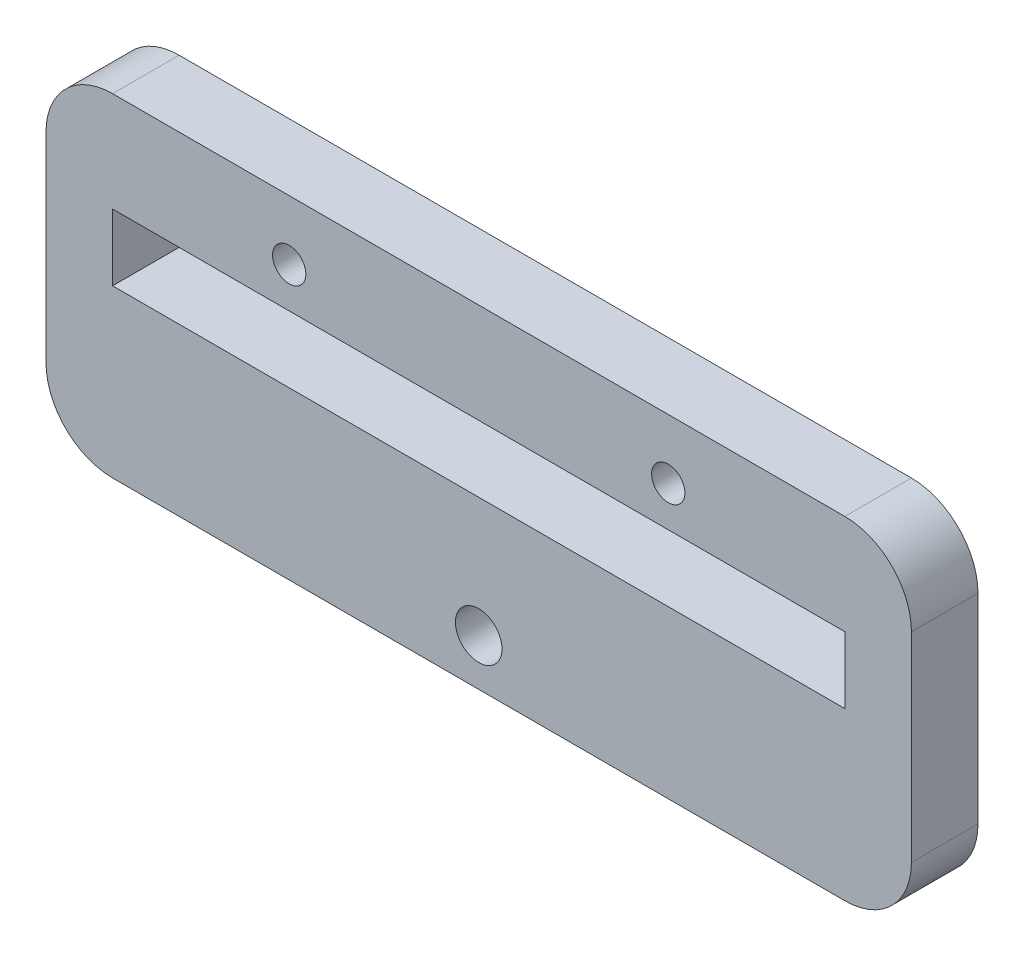
ISO-10303-21;
HEADER;
FILE_DESCRIPTION(('STEP AP214'),'2;1');
FILE_NAME('part.step','',(''),(''),'','','');
FILE_SCHEMA(('AUTOMOTIVE_DESIGN { 1 0 10303 214 1 1 1 1 }'));
ENDSEC;
DATA;
#1=APPLICATION_CONTEXT('core data for automotive mechanical design processes');
#2=APPLICATION_PROTOCOL_DEFINITION('international standard','automotive_design',2000,#1);
#3=PRODUCT_CONTEXT('',#1,'mechanical');
#4=PRODUCT('Part','Part','',(#3));
#5=PRODUCT_RELATED_PRODUCT_CATEGORY('part','',(#4));
#6=PRODUCT_DEFINITION_FORMATION('','',#4);
#7=PRODUCT_DEFINITION_CONTEXT('part definition',#1,'design');
#8=PRODUCT_DEFINITION('design','',#6,#7);
#9=PRODUCT_DEFINITION_SHAPE('','',#8);
#10=(LENGTH_UNIT() NAMED_UNIT(*) SI_UNIT(.MILLI.,.METRE.));
#11=(NAMED_UNIT(*) PLANE_ANGLE_UNIT() SI_UNIT($,.RADIAN.));
#12=(NAMED_UNIT(*) SI_UNIT($,.STERADIAN.) SOLID_ANGLE_UNIT());
#13=UNCERTAINTY_MEASURE_WITH_UNIT(LENGTH_MEASURE(1.E-05),#10,'distance_accuracy_value','');
#14=(GEOMETRIC_REPRESENTATION_CONTEXT(3) GLOBAL_UNCERTAINTY_ASSIGNED_CONTEXT((#13)) GLOBAL_UNIT_ASSIGNED_CONTEXT((#10,
#11,#12)) REPRESENTATION_CONTEXT('',''));
#15=CARTESIAN_POINT('',(0.,0.,0.));
#16=DIRECTION('',(0.,0.,1.));
#17=DIRECTION('',(1.,0.,0.));
#18=AXIS2_PLACEMENT_3D('',#15,#16,#17);
#19=CARTESIAN_POINT('',(0.,0.,10.));
#20=DIRECTION('',(0.,0.,-1.));
#21=DIRECTION('',(-1.,0.,0.));
#22=AXIS2_PLACEMENT_3D('',#19,#20,#21);
#23=PLANE('',#22);
#24=DIRECTION('',(0.,-1.,0.));
#25=VECTOR('',#24,1.);
#26=CARTESIAN_POINT('',(0.,0.,10.));
#27=LINE('',#26,#25);
#28=CARTESIAN_POINT('',(0.,40.,10.));
#29=VERTEX_POINT('',#28);
#30=CARTESIAN_POINT('',(0.,10.,10.));
#31=VERTEX_POINT('',#30);
#32=EDGE_CURVE('E167',#29,#31,#27,.T.);
#33=ORIENTED_EDGE('',*,*,#32,.T.);
#34=CARTESIAN_POINT('',(10.,10.,10.));
#35=DIRECTION('',(0.,0.,-1.));
#36=DIRECTION('',(-1.,0.,0.));
#37=AXIS2_PLACEMENT_3D('',#34,#35,#36);
#38=CIRCLE('',#37,10.);
#39=CARTESIAN_POINT('',(10.,0.,10.));
#40=VERTEX_POINT('',#39);
#41=EDGE_CURVE('E210',#31,#40,#38,.F.);
#42=ORIENTED_EDGE('',*,*,#41,.T.);
#43=DIRECTION('',(1.,0.,0.));
#44=VECTOR('',#43,1.);
#45=CARTESIAN_POINT('',(0.,0.,10.));
#46=LINE('',#45,#44);
#47=CARTESIAN_POINT('',(120.,0.,10.));
#48=VERTEX_POINT('',#47);
#49=EDGE_CURVE('E170',#40,#48,#46,.T.);
#50=ORIENTED_EDGE('',*,*,#49,.T.);
#51=CARTESIAN_POINT('',(120.,10.,10.));
#52=DIRECTION('',(0.,0.,-1.));
#53=DIRECTION('',(-1.,0.,0.));
#54=AXIS2_PLACEMENT_3D('',#51,#52,#53);
#55=CIRCLE('',#54,10.);
#56=CARTESIAN_POINT('',(130.,10.,10.));
#57=VERTEX_POINT('',#56);
#58=EDGE_CURVE('E208',#48,#57,#55,.F.);
#59=ORIENTED_EDGE('',*,*,#58,.T.);
#60=DIRECTION('',(0.,1.,0.));
#61=VECTOR('',#60,1.);
#62=CARTESIAN_POINT('',(130.,0.,10.));
#63=LINE('',#62,#61);
#64=CARTESIAN_POINT('',(130.,40.,10.));
#65=VERTEX_POINT('',#64);
#66=EDGE_CURVE('E174',#57,#65,#63,.T.);
#67=ORIENTED_EDGE('',*,*,#66,.T.);
#68=CARTESIAN_POINT('',(120.,40.,10.));
#69=DIRECTION('',(0.,0.,-1.));
#70=DIRECTION('',(-1.,0.,0.));
#71=AXIS2_PLACEMENT_3D('',#68,#69,#70);
#72=CIRCLE('',#71,10.);
#73=CARTESIAN_POINT('',(120.,50.,10.));
#74=VERTEX_POINT('',#73);
#75=EDGE_CURVE('E53',#65,#74,#72,.F.);
#76=ORIENTED_EDGE('',*,*,#75,.T.);
#77=DIRECTION('',(-1.,0.,0.));
#78=VECTOR('',#77,1.);
#79=CARTESIAN_POINT('',(0.,50.,10.));
#80=LINE('',#79,#78);
#81=CARTESIAN_POINT('',(10.,50.,10.));
#82=VERTEX_POINT('',#81);
#83=EDGE_CURVE('E176',#74,#82,#80,.T.);
#84=ORIENTED_EDGE('',*,*,#83,.T.);
#85=CARTESIAN_POINT('',(10.,40.,10.));
#86=DIRECTION('',(0.,0.,-1.));
#87=DIRECTION('',(-1.,0.,0.));
#88=AXIS2_PLACEMENT_3D('',#85,#86,#87);
#89=CIRCLE('',#88,10.);
#90=EDGE_CURVE('E206',#82,#29,#89,.F.);
#91=ORIENTED_EDGE('',*,*,#90,.T.);
#92=EDGE_LOOP('',(#33,#42,#50,#59,#67,#76,#84,#91));
#93=FACE_BOUND('',#92,.T.);
#94=DIRECTION('',(0.,-1.,0.));
#95=VECTOR('',#94,1.);
#96=CARTESIAN_POINT('',(10.,25.,10.));
#97=LINE('',#96,#95);
#98=CARTESIAN_POINT('',(10.,35.,10.));
#99=VERTEX_POINT('',#98);
#100=CARTESIAN_POINT('',(10.,25.,10.));
#101=VERTEX_POINT('',#100);
#102=EDGE_CURVE('E123',#99,#101,#97,.T.);
#103=ORIENTED_EDGE('',*,*,#102,.F.);
#104=DIRECTION('',(-1.,0.,0.));
#105=VECTOR('',#104,1.);
#106=CARTESIAN_POINT('',(10.,35.,10.));
#107=LINE('',#106,#105);
#108=CARTESIAN_POINT('',(120.,35.,10.));
#109=VERTEX_POINT('',#108);
#110=EDGE_CURVE('E149',#109,#99,#107,.T.);
#111=ORIENTED_EDGE('',*,*,#110,.F.);
#112=DIRECTION('',(0.,1.,0.));
#113=VECTOR('',#112,1.);
#114=CARTESIAN_POINT('',(120.,25.,10.));
#115=LINE('',#114,#113);
#116=CARTESIAN_POINT('',(120.,25.,10.));
#117=VERTEX_POINT('',#116);
#118=EDGE_CURVE('E147',#117,#109,#115,.T.);
#119=ORIENTED_EDGE('',*,*,#118,.F.);
#120=DIRECTION('',(1.,0.,0.));
#121=VECTOR('',#120,1.);
#122=CARTESIAN_POINT('',(10.,25.,10.));
#123=LINE('',#122,#121);
#124=EDGE_CURVE('E133',#101,#117,#123,.T.);
#125=ORIENTED_EDGE('',*,*,#124,.F.);
#126=EDGE_LOOP('',(#103,#111,#119,#125));
#127=FACE_BOUND('',#126,.T.);
#128=CARTESIAN_POINT('',(36.53,41.03,10.));
#129=DIRECTION('',(0.,0.,1.));
#130=DIRECTION('',(1.,0.,0.));
#131=AXIS2_PLACEMENT_3D('',#128,#129,#130);
#132=CIRCLE('',#131,2.5);
#133=CARTESIAN_POINT('',(39.03,41.03,10.));
#134=VERTEX_POINT('',#133);
#135=EDGE_CURVE('E156',#134,#134,#132,.T.);
#136=ORIENTED_EDGE('',*,*,#135,.F.);
#137=EDGE_LOOP('',(#136));
#138=FACE_BOUND('',#137,.T.);
#139=CARTESIAN_POINT('',(93.47,41.03,10.));
#140=DIRECTION('',(0.,0.,1.));
#141=DIRECTION('',(1.,0.,0.));
#142=AXIS2_PLACEMENT_3D('',#139,#140,#141);
#143=CIRCLE('',#142,2.5);
#144=CARTESIAN_POINT('',(95.97,41.03,10.));
#145=VERTEX_POINT('',#144);
#146=EDGE_CURVE('E405',#145,#145,#143,.T.);
#147=ORIENTED_EDGE('',*,*,#146,.F.);
#148=EDGE_LOOP('',(#147));
#149=FACE_BOUND('',#148,.T.);
#150=CARTESIAN_POINT('',(65.,7.,10.));
#151=DIRECTION('',(0.,0.,1.));
#152=DIRECTION('',(1.,0.,0.));
#153=AXIS2_PLACEMENT_3D('',#150,#151,#152);
#154=CIRCLE('',#153,3.50000000000001);
#155=CARTESIAN_POINT('',(68.5,7.,10.));
#156=VERTEX_POINT('',#155);
#157=EDGE_CURVE('E412',#156,#156,#154,.T.);
#158=ORIENTED_EDGE('',*,*,#157,.F.);
#159=EDGE_LOOP('',(#158));
#160=FACE_BOUND('',#159,.T.);
#161=ADVANCED_FACE('F33',(#93,#127,#138,#149,#160),#23,.F.);
#162=CARTESIAN_POINT('',(0.,0.,0.));
#163=DIRECTION('',(0.,0.,-1.));
#164=DIRECTION('',(-1.,0.,0.));
#165=AXIS2_PLACEMENT_3D('',#162,#163,#164);
#166=PLANE('',#165);
#167=CARTESIAN_POINT('',(93.47,41.03,0.));
#168=DIRECTION('',(0.,0.,1.));
#169=DIRECTION('',(1.,0.,0.));
#170=AXIS2_PLACEMENT_3D('',#167,#168,#169);
#171=CIRCLE('',#170,2.5);
#172=CARTESIAN_POINT('',(95.97,41.03,0.));
#173=VERTEX_POINT('',#172);
#174=EDGE_CURVE('E408',#173,#173,#171,.T.);
#175=ORIENTED_EDGE('',*,*,#174,.T.);
#176=EDGE_LOOP('',(#175));
#177=FACE_BOUND('',#176,.T.);
#178=DIRECTION('',(-1.,0.,0.));
#179=VECTOR('',#178,1.);
#180=CARTESIAN_POINT('',(10.,35.,0.));
#181=LINE('',#180,#179);
#182=CARTESIAN_POINT('',(120.,35.,0.));
#183=VERTEX_POINT('',#182);
#184=CARTESIAN_POINT('',(10.,35.,0.));
#185=VERTEX_POINT('',#184);
#186=EDGE_CURVE('E134',#183,#185,#181,.T.);
#187=ORIENTED_EDGE('',*,*,#186,.T.);
#188=DIRECTION('',(0.,-1.,0.));
#189=VECTOR('',#188,1.);
#190=CARTESIAN_POINT('',(10.,25.,0.));
#191=LINE('',#190,#189);
#192=CARTESIAN_POINT('',(10.,25.,0.));
#193=VERTEX_POINT('',#192);
#194=EDGE_CURVE('E154',#185,#193,#191,.T.);
#195=ORIENTED_EDGE('',*,*,#194,.T.);
#196=DIRECTION('',(1.,0.,0.));
#197=VECTOR('',#196,1.);
#198=CARTESIAN_POINT('',(10.,25.,0.));
#199=LINE('',#198,#197);
#200=CARTESIAN_POINT('',(120.,25.,0.));
#201=VERTEX_POINT('',#200);
#202=EDGE_CURVE('E140',#193,#201,#199,.T.);
#203=ORIENTED_EDGE('',*,*,#202,.T.);
#204=DIRECTION('',(0.,1.,0.));
#205=VECTOR('',#204,1.);
#206=CARTESIAN_POINT('',(120.,25.,0.));
#207=LINE('',#206,#205);
#208=EDGE_CURVE('E158',#201,#183,#207,.T.);
#209=ORIENTED_EDGE('',*,*,#208,.T.);
#210=EDGE_LOOP('',(#187,#195,#203,#209));
#211=FACE_BOUND('',#210,.T.);
#212=DIRECTION('',(1.,0.,0.));
#213=VECTOR('',#212,1.);
#214=CARTESIAN_POINT('',(0.,0.,0.));
#215=LINE('',#214,#213);
#216=CARTESIAN_POINT('',(10.,0.,0.));
#217=VERTEX_POINT('',#216);
#218=CARTESIAN_POINT('',(120.,0.,0.));
#219=VERTEX_POINT('',#218);
#220=EDGE_CURVE('E181',#217,#219,#215,.T.);
#221=ORIENTED_EDGE('',*,*,#220,.F.);
#222=CARTESIAN_POINT('',(10.,10.,0.));
#223=DIRECTION('',(0.,0.,-1.));
#224=DIRECTION('',(-1.,0.,0.));
#225=AXIS2_PLACEMENT_3D('',#222,#223,#224);
#226=CIRCLE('',#225,10.);
#227=CARTESIAN_POINT('',(0.,10.,0.));
#228=VERTEX_POINT('',#227);
#229=EDGE_CURVE('E198',#217,#228,#226,.T.);
#230=ORIENTED_EDGE('',*,*,#229,.T.);
#231=DIRECTION('',(0.,-1.,0.));
#232=VECTOR('',#231,1.);
#233=CARTESIAN_POINT('',(0.,0.,0.));
#234=LINE('',#233,#232);
#235=CARTESIAN_POINT('',(0.,40.,0.));
#236=VERTEX_POINT('',#235);
#237=EDGE_CURVE('E141',#236,#228,#234,.T.);
#238=ORIENTED_EDGE('',*,*,#237,.F.);
#239=CARTESIAN_POINT('',(10.,40.,0.));
#240=DIRECTION('',(0.,0.,-1.));
#241=DIRECTION('',(-1.,0.,0.));
#242=AXIS2_PLACEMENT_3D('',#239,#240,#241);
#243=CIRCLE('',#242,10.);
#244=CARTESIAN_POINT('',(10.,50.,0.));
#245=VERTEX_POINT('',#244);
#246=EDGE_CURVE('E194',#236,#245,#243,.T.);
#247=ORIENTED_EDGE('',*,*,#246,.T.);
#248=DIRECTION('',(-1.,0.,0.));
#249=VECTOR('',#248,1.);
#250=CARTESIAN_POINT('',(0.,50.,0.));
#251=LINE('',#250,#249);
#252=CARTESIAN_POINT('',(120.,50.,0.));
#253=VERTEX_POINT('',#252);
#254=EDGE_CURVE('E171',#253,#245,#251,.T.);
#255=ORIENTED_EDGE('',*,*,#254,.F.);
#256=CARTESIAN_POINT('',(120.,40.,0.));
#257=DIRECTION('',(0.,0.,-1.));
#258=DIRECTION('',(-1.,0.,0.));
#259=AXIS2_PLACEMENT_3D('',#256,#257,#258);
#260=CIRCLE('',#259,10.);
#261=CARTESIAN_POINT('',(130.,40.,0.));
#262=VERTEX_POINT('',#261);
#263=EDGE_CURVE('E192',#253,#262,#260,.T.);
#264=ORIENTED_EDGE('',*,*,#263,.T.);
#265=DIRECTION('',(0.,1.,0.));
#266=VECTOR('',#265,1.);
#267=CARTESIAN_POINT('',(130.,0.,0.));
#268=LINE('',#267,#266);
#269=CARTESIAN_POINT('',(130.,10.,0.));
#270=VERTEX_POINT('',#269);
#271=EDGE_CURVE('E184',#270,#262,#268,.T.);
#272=ORIENTED_EDGE('',*,*,#271,.F.);
#273=CARTESIAN_POINT('',(120.,10.,0.));
#274=DIRECTION('',(0.,0.,-1.));
#275=DIRECTION('',(-1.,0.,0.));
#276=AXIS2_PLACEMENT_3D('',#273,#274,#275);
#277=CIRCLE('',#276,10.);
#278=EDGE_CURVE('E196',#270,#219,#277,.T.);
#279=ORIENTED_EDGE('',*,*,#278,.T.);
#280=EDGE_LOOP('',(#221,#230,#238,#247,#255,#264,#272,#279));
#281=FACE_BOUND('',#280,.T.);
#282=CARTESIAN_POINT('',(36.53,41.03,0.));
#283=DIRECTION('',(0.,0.,1.));
#284=DIRECTION('',(1.,0.,0.));
#285=AXIS2_PLACEMENT_3D('',#282,#283,#284);
#286=CIRCLE('',#285,2.5);
#287=CARTESIAN_POINT('',(39.03,41.03,0.));
#288=VERTEX_POINT('',#287);
#289=EDGE_CURVE('E404',#288,#288,#286,.T.);
#290=ORIENTED_EDGE('',*,*,#289,.T.);
#291=EDGE_LOOP('',(#290));
#292=FACE_BOUND('',#291,.T.);
#293=CARTESIAN_POINT('',(65.,7.,0.));
#294=DIRECTION('',(0.,0.,1.));
#295=DIRECTION('',(1.,0.,0.));
#296=AXIS2_PLACEMENT_3D('',#293,#294,#295);
#297=CIRCLE('',#296,3.50000000000001);
#298=CARTESIAN_POINT('',(68.5,7.,0.));
#299=VERTEX_POINT('',#298);
#300=EDGE_CURVE('E414',#299,#299,#297,.T.);
#301=ORIENTED_EDGE('',*,*,#300,.T.);
#302=EDGE_LOOP('',(#301));
#303=FACE_BOUND('',#302,.T.);
#304=ADVANCED_FACE('F223',(#177,#211,#281,#292,#303),#166,.T.);
#305=CARTESIAN_POINT('',(0.,0.,10.));
#306=DIRECTION('',(1.,0.,0.));
#307=DIRECTION('',(0.,0.,-1.));
#308=AXIS2_PLACEMENT_3D('',#305,#306,#307);
#309=PLANE('',#308);
#310=ORIENTED_EDGE('',*,*,#237,.T.);
#311=DIRECTION('',(0.,0.,-1.));
#312=VECTOR('',#311,1.);
#313=CARTESIAN_POINT('',(0.,10.,10.));
#314=LINE('',#313,#312);
#315=EDGE_CURVE('E203',#228,#31,#314,.F.);
#316=ORIENTED_EDGE('',*,*,#315,.T.);
#317=ORIENTED_EDGE('',*,*,#32,.F.);
#318=DIRECTION('',(0.,0.,-1.));
#319=VECTOR('',#318,1.);
#320=CARTESIAN_POINT('',(0.,40.,10.));
#321=LINE('',#320,#319);
#322=EDGE_CURVE('E200',#29,#236,#321,.T.);
#323=ORIENTED_EDGE('',*,*,#322,.T.);
#324=EDGE_LOOP('',(#310,#316,#317,#323));
#325=FACE_BOUND('',#324,.T.);
#326=ADVANCED_FACE('F233',(#325),#309,.F.);
#327=CARTESIAN_POINT('',(0.,0.,10.));
#328=DIRECTION('',(0.,1.,0.));
#329=DIRECTION('',(0.,0.,1.));
#330=AXIS2_PLACEMENT_3D('',#327,#328,#329);
#331=PLANE('',#330);
#332=ORIENTED_EDGE('',*,*,#49,.F.);
#333=DIRECTION('',(0.,0.,-1.));
#334=VECTOR('',#333,1.);
#335=CARTESIAN_POINT('',(10.,0.,10.));
#336=LINE('',#335,#334);
#337=EDGE_CURVE('E189',#40,#217,#336,.T.);
#338=ORIENTED_EDGE('',*,*,#337,.T.);
#339=ORIENTED_EDGE('',*,*,#220,.T.);
#340=DIRECTION('',(0.,0.,-1.));
#341=VECTOR('',#340,1.);
#342=CARTESIAN_POINT('',(120.,0.,10.));
#343=LINE('',#342,#341);
#344=EDGE_CURVE('E178',#219,#48,#343,.F.);
#345=ORIENTED_EDGE('',*,*,#344,.T.);
#346=EDGE_LOOP('',(#332,#338,#339,#345));
#347=FACE_BOUND('',#346,.T.);
#348=ADVANCED_FACE('F241',(#347),#331,.F.);
#349=CARTESIAN_POINT('',(130.,0.,10.));
#350=DIRECTION('',(-1.,0.,0.));
#351=DIRECTION('',(0.,0.,1.));
#352=AXIS2_PLACEMENT_3D('',#349,#350,#351);
#353=PLANE('',#352);
#354=ORIENTED_EDGE('',*,*,#66,.F.);
#355=DIRECTION('',(0.,0.,-1.));
#356=VECTOR('',#355,1.);
#357=CARTESIAN_POINT('',(130.,10.,10.));
#358=LINE('',#357,#356);
#359=EDGE_CURVE('E214',#57,#270,#358,.T.);
#360=ORIENTED_EDGE('',*,*,#359,.T.);
#361=ORIENTED_EDGE('',*,*,#271,.T.);
#362=DIRECTION('',(0.,0.,-1.));
#363=VECTOR('',#362,1.);
#364=CARTESIAN_POINT('',(130.,40.,10.));
#365=LINE('',#364,#363);
#366=EDGE_CURVE('E212',#262,#65,#365,.F.);
#367=ORIENTED_EDGE('',*,*,#366,.T.);
#368=EDGE_LOOP('',(#354,#360,#361,#367));
#369=FACE_BOUND('',#368,.T.);
#370=ADVANCED_FACE('F249',(#369),#353,.F.);
#371=CARTESIAN_POINT('',(0.,50.,10.));
#372=DIRECTION('',(0.,-1.,0.));
#373=DIRECTION('',(0.,0.,-1.));
#374=AXIS2_PLACEMENT_3D('',#371,#372,#373);
#375=PLANE('',#374);
#376=ORIENTED_EDGE('',*,*,#254,.T.);
#377=DIRECTION('',(0.,0.,-1.));
#378=VECTOR('',#377,1.);
#379=CARTESIAN_POINT('',(10.,50.,10.));
#380=LINE('',#379,#378);
#381=EDGE_CURVE('E11',#245,#82,#380,.F.);
#382=ORIENTED_EDGE('',*,*,#381,.T.);
#383=ORIENTED_EDGE('',*,*,#83,.F.);
#384=DIRECTION('',(0.,0.,-1.));
#385=VECTOR('',#384,1.);
#386=CARTESIAN_POINT('',(120.,50.,10.));
#387=LINE('',#386,#385);
#388=EDGE_CURVE('E41',#74,#253,#387,.T.);
#389=ORIENTED_EDGE('',*,*,#388,.T.);
#390=EDGE_LOOP('',(#376,#382,#383,#389));
#391=FACE_BOUND('',#390,.T.);
#392=ADVANCED_FACE('F219',(#391),#375,.F.);
#393=CARTESIAN_POINT('',(10.,25.,10.));
#394=DIRECTION('',(1.,0.,0.));
#395=DIRECTION('',(0.,0.,-1.));
#396=AXIS2_PLACEMENT_3D('',#393,#394,#395);
#397=PLANE('',#396);
#398=ORIENTED_EDGE('',*,*,#194,.F.);
#399=DIRECTION('',(0.,0.,-1.));
#400=VECTOR('',#399,1.);
#401=CARTESIAN_POINT('',(10.,35.,10.));
#402=LINE('',#401,#400);
#403=EDGE_CURVE('E129',#99,#185,#402,.T.);
#404=ORIENTED_EDGE('',*,*,#403,.F.);
#405=ORIENTED_EDGE('',*,*,#102,.T.);
#406=DIRECTION('',(0.,0.,-1.));
#407=VECTOR('',#406,1.);
#408=CARTESIAN_POINT('',(10.,25.,10.));
#409=LINE('',#408,#407);
#410=EDGE_CURVE('E126',#101,#193,#409,.T.);
#411=ORIENTED_EDGE('',*,*,#410,.T.);
#412=EDGE_LOOP('',(#398,#404,#405,#411));
#413=FACE_BOUND('',#412,.T.);
#414=ADVANCED_FACE('F125',(#413),#397,.T.);
#415=CARTESIAN_POINT('',(10.,25.,10.));
#416=DIRECTION('',(0.,1.,0.));
#417=DIRECTION('',(0.,0.,1.));
#418=AXIS2_PLACEMENT_3D('',#415,#416,#417);
#419=PLANE('',#418);
#420=ORIENTED_EDGE('',*,*,#202,.F.);
#421=ORIENTED_EDGE('',*,*,#410,.F.);
#422=ORIENTED_EDGE('',*,*,#124,.T.);
#423=DIRECTION('',(0.,0.,-1.));
#424=VECTOR('',#423,1.);
#425=CARTESIAN_POINT('',(120.,25.,10.));
#426=LINE('',#425,#424);
#427=EDGE_CURVE('E142',#117,#201,#426,.T.);
#428=ORIENTED_EDGE('',*,*,#427,.T.);
#429=EDGE_LOOP('',(#420,#421,#422,#428));
#430=FACE_BOUND('',#429,.T.);
#431=ADVANCED_FACE('F137',(#430),#419,.T.);
#432=CARTESIAN_POINT('',(120.,25.,10.));
#433=DIRECTION('',(-1.,0.,0.));
#434=DIRECTION('',(0.,0.,1.));
#435=AXIS2_PLACEMENT_3D('',#432,#433,#434);
#436=PLANE('',#435);
#437=ORIENTED_EDGE('',*,*,#208,.F.);
#438=ORIENTED_EDGE('',*,*,#427,.F.);
#439=ORIENTED_EDGE('',*,*,#118,.T.);
#440=DIRECTION('',(0.,0.,-1.));
#441=VECTOR('',#440,1.);
#442=CARTESIAN_POINT('',(120.,35.,10.));
#443=LINE('',#442,#441);
#444=EDGE_CURVE('E164',#109,#183,#443,.T.);
#445=ORIENTED_EDGE('',*,*,#444,.T.);
#446=EDGE_LOOP('',(#437,#438,#439,#445));
#447=FACE_BOUND('',#446,.T.);
#448=ADVANCED_FACE('F333',(#447),#436,.T.);
#449=CARTESIAN_POINT('',(10.,35.,10.));
#450=DIRECTION('',(0.,-1.,0.));
#451=DIRECTION('',(0.,0.,-1.));
#452=AXIS2_PLACEMENT_3D('',#449,#450,#451);
#453=PLANE('',#452);
#454=ORIENTED_EDGE('',*,*,#186,.F.);
#455=ORIENTED_EDGE('',*,*,#444,.F.);
#456=ORIENTED_EDGE('',*,*,#110,.T.);
#457=ORIENTED_EDGE('',*,*,#403,.T.);
#458=EDGE_LOOP('',(#454,#455,#456,#457));
#459=FACE_BOUND('',#458,.T.);
#460=ADVANCED_FACE('F324',(#459),#453,.T.);
#461=CARTESIAN_POINT('',(36.53,41.03,10.));
#462=DIRECTION('',(0.,0.,-1.));
#463=DIRECTION('',(-1.,0.,0.));
#464=AXIS2_PLACEMENT_3D('',#461,#462,#463);
#465=CYLINDRICAL_SURFACE('',#464,2.5);
#466=ORIENTED_EDGE('',*,*,#135,.T.);
#467=EDGE_LOOP('',(#466));
#468=FACE_BOUND('',#467,.T.);
#469=ORIENTED_EDGE('',*,*,#289,.F.);
#470=EDGE_LOOP('',(#469));
#471=FACE_BOUND('',#470,.T.);
#472=ADVANCED_FACE('F315',(#468,#471),#465,.F.);
#473=CARTESIAN_POINT('',(93.47,41.03,10.));
#474=DIRECTION('',(0.,0.,-1.));
#475=DIRECTION('',(-1.,0.,0.));
#476=AXIS2_PLACEMENT_3D('',#473,#474,#475);
#477=CYLINDRICAL_SURFACE('',#476,2.5);
#478=ORIENTED_EDGE('',*,*,#146,.T.);
#479=EDGE_LOOP('',(#478));
#480=FACE_BOUND('',#479,.T.);
#481=ORIENTED_EDGE('',*,*,#174,.F.);
#482=EDGE_LOOP('',(#481));
#483=FACE_BOUND('',#482,.T.);
#484=ADVANCED_FACE('F306',(#480,#483),#477,.F.);
#485=CARTESIAN_POINT('',(65.,7.,10.));
#486=DIRECTION('',(0.,0.,-1.));
#487=DIRECTION('',(-1.,0.,0.));
#488=AXIS2_PLACEMENT_3D('',#485,#486,#487);
#489=CYLINDRICAL_SURFACE('',#488,3.50000000000001);
#490=ORIENTED_EDGE('',*,*,#157,.T.);
#491=EDGE_LOOP('',(#490));
#492=FACE_BOUND('',#491,.T.);
#493=ORIENTED_EDGE('',*,*,#300,.F.);
#494=EDGE_LOOP('',(#493));
#495=FACE_BOUND('',#494,.T.);
#496=ADVANCED_FACE('F275',(#492,#495),#489,.F.);
#497=CARTESIAN_POINT('',(10.,10.,10.));
#498=DIRECTION('',(0.,0.,-1.));
#499=DIRECTION('',(-1.,0.,0.));
#500=AXIS2_PLACEMENT_3D('',#497,#498,#499);
#501=CYLINDRICAL_SURFACE('',#500,10.);
#502=ORIENTED_EDGE('',*,*,#41,.F.);
#503=ORIENTED_EDGE('',*,*,#315,.F.);
#504=ORIENTED_EDGE('',*,*,#229,.F.);
#505=ORIENTED_EDGE('',*,*,#337,.F.);
#506=EDGE_LOOP('',(#502,#503,#504,#505));
#507=FACE_BOUND('',#506,.T.);
#508=ADVANCED_FACE('F239',(#507),#501,.T.);
#509=CARTESIAN_POINT('',(120.,10.,10.));
#510=DIRECTION('',(0.,0.,-1.));
#511=DIRECTION('',(-1.,0.,0.));
#512=AXIS2_PLACEMENT_3D('',#509,#510,#511);
#513=CYLINDRICAL_SURFACE('',#512,10.);
#514=ORIENTED_EDGE('',*,*,#58,.F.);
#515=ORIENTED_EDGE('',*,*,#344,.F.);
#516=ORIENTED_EDGE('',*,*,#278,.F.);
#517=ORIENTED_EDGE('',*,*,#359,.F.);
#518=EDGE_LOOP('',(#514,#515,#516,#517));
#519=FACE_BOUND('',#518,.T.);
#520=ADVANCED_FACE('F246',(#519),#513,.T.);
#521=CARTESIAN_POINT('',(10.,40.,10.));
#522=DIRECTION('',(0.,0.,-1.));
#523=DIRECTION('',(-1.,0.,0.));
#524=AXIS2_PLACEMENT_3D('',#521,#522,#523);
#525=CYLINDRICAL_SURFACE('',#524,10.);
#526=ORIENTED_EDGE('',*,*,#90,.F.);
#527=ORIENTED_EDGE('',*,*,#381,.F.);
#528=ORIENTED_EDGE('',*,*,#246,.F.);
#529=ORIENTED_EDGE('',*,*,#322,.F.);
#530=EDGE_LOOP('',(#526,#527,#528,#529));
#531=FACE_BOUND('',#530,.T.);
#532=ADVANCED_FACE('F230',(#531),#525,.T.);
#533=CARTESIAN_POINT('',(120.,40.,10.));
#534=DIRECTION('',(0.,0.,-1.));
#535=DIRECTION('',(-1.,0.,0.));
#536=AXIS2_PLACEMENT_3D('',#533,#534,#535);
#537=CYLINDRICAL_SURFACE('',#536,10.);
#538=ORIENTED_EDGE('',*,*,#75,.F.);
#539=ORIENTED_EDGE('',*,*,#366,.F.);
#540=ORIENTED_EDGE('',*,*,#263,.F.);
#541=ORIENTED_EDGE('',*,*,#388,.F.);
#542=EDGE_LOOP('',(#538,#539,#540,#541));
#543=FACE_BOUND('',#542,.T.);
#544=ADVANCED_FACE('F35',(#543),#537,.T.);
#545=CLOSED_SHELL('',(#161,#304,#326,#348,#370,#392,#414,#431,#448,#460,#472,#484,#496,#508,
#520,#532,#544));
#546=MANIFOLD_SOLID_BREP('B2',#545);
#547=ADVANCED_BREP_SHAPE_REPRESENTATION('',(#18,#546),#14);
#548=SHAPE_DEFINITION_REPRESENTATION(#9,#547);
ENDSEC;
END-ISO-10303-21;
